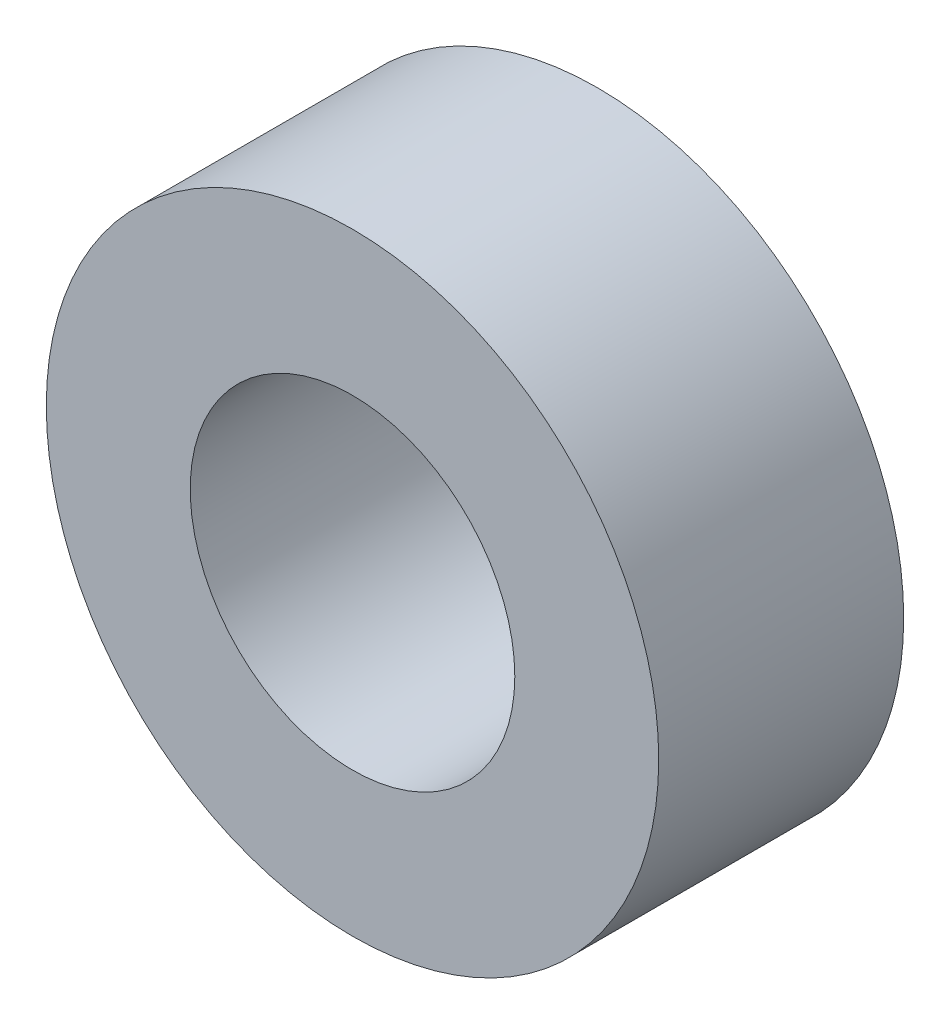
ISO-10303-21;
HEADER;
FILE_DESCRIPTION(('STEP AP214'),'2;1');
FILE_NAME('part.step','',(''),(''),'','','');
FILE_SCHEMA(('AUTOMOTIVE_DESIGN { 1 0 10303 214 1 1 1 1 }'));
ENDSEC;
DATA;
#1=APPLICATION_CONTEXT('core data for automotive mechanical design processes');
#2=APPLICATION_PROTOCOL_DEFINITION('international standard','automotive_design',2000,#1);
#3=PRODUCT_CONTEXT('',#1,'mechanical');
#4=PRODUCT('Part','Part','',(#3));
#5=PRODUCT_RELATED_PRODUCT_CATEGORY('part','',(#4));
#6=PRODUCT_DEFINITION_FORMATION('','',#4);
#7=PRODUCT_DEFINITION_CONTEXT('part definition',#1,'design');
#8=PRODUCT_DEFINITION('design','',#6,#7);
#9=PRODUCT_DEFINITION_SHAPE('','',#8);
#10=(LENGTH_UNIT() NAMED_UNIT(*) SI_UNIT(.MILLI.,.METRE.));
#11=(NAMED_UNIT(*) PLANE_ANGLE_UNIT() SI_UNIT($,.RADIAN.));
#12=(NAMED_UNIT(*) SI_UNIT($,.STERADIAN.) SOLID_ANGLE_UNIT());
#13=UNCERTAINTY_MEASURE_WITH_UNIT(LENGTH_MEASURE(1.E-05),#10,'distance_accuracy_value','');
#14=(GEOMETRIC_REPRESENTATION_CONTEXT(3) GLOBAL_UNCERTAINTY_ASSIGNED_CONTEXT((#13)) GLOBAL_UNIT_ASSIGNED_CONTEXT((#10,
#11,#12)) REPRESENTATION_CONTEXT('',''));
#15=CARTESIAN_POINT('',(0.,0.,0.));
#16=DIRECTION('',(0.,0.,1.));
#17=DIRECTION('',(1.,0.,0.));
#18=AXIS2_PLACEMENT_3D('',#15,#16,#17);
#19=CARTESIAN_POINT('',(0.,0.,2.));
#20=DIRECTION('',(0.,0.,1.));
#21=DIRECTION('',(1.,0.,0.));
#22=AXIS2_PLACEMENT_3D('',#19,#20,#21);
#23=PLANE('',#22);
#24=CARTESIAN_POINT('',(0.,0.,2.));
#25=DIRECTION('',(0.,0.,1.));
#26=DIRECTION('',(1.,0.,0.));
#27=AXIS2_PLACEMENT_3D('',#24,#25,#26);
#28=CIRCLE('',#27,5.);
#29=CARTESIAN_POINT('',(5.,0.,2.));
#30=VERTEX_POINT('',#29);
#31=EDGE_CURVE('E10',#30,#30,#28,.T.);
#32=ORIENTED_EDGE('',*,*,#31,.T.);
#33=EDGE_LOOP('',(#32));
#34=FACE_BOUND('',#33,.T.);
#35=CARTESIAN_POINT('',(0.,0.,2.));
#36=DIRECTION('',(0.,0.,1.));
#37=DIRECTION('',(1.,0.,0.));
#38=AXIS2_PLACEMENT_3D('',#35,#36,#37);
#39=CIRCLE('',#38,2.65);
#40=CARTESIAN_POINT('',(2.65,0.,2.));
#41=VERTEX_POINT('',#40);
#42=EDGE_CURVE('E41',#41,#41,#39,.T.);
#43=ORIENTED_EDGE('',*,*,#42,.F.);
#44=EDGE_LOOP('',(#43));
#45=FACE_BOUND('',#44,.T.);
#46=ADVANCED_FACE('F30',(#34,#45),#23,.T.);
#47=CARTESIAN_POINT('',(0.,0.,-2.));
#48=DIRECTION('',(0.,0.,1.));
#49=DIRECTION('',(1.,0.,0.));
#50=AXIS2_PLACEMENT_3D('',#47,#48,#49);
#51=PLANE('',#50);
#52=CARTESIAN_POINT('',(0.,0.,-2.));
#53=DIRECTION('',(0.,0.,1.));
#54=DIRECTION('',(1.,0.,0.));
#55=AXIS2_PLACEMENT_3D('',#52,#53,#54);
#56=CIRCLE('',#55,5.);
#57=CARTESIAN_POINT('',(5.,0.,-2.));
#58=VERTEX_POINT('',#57);
#59=EDGE_CURVE('E34',#58,#58,#56,.T.);
#60=ORIENTED_EDGE('',*,*,#59,.F.);
#61=EDGE_LOOP('',(#60));
#62=FACE_BOUND('',#61,.T.);
#63=CARTESIAN_POINT('',(0.,0.,-2.));
#64=DIRECTION('',(0.,0.,1.));
#65=DIRECTION('',(1.,0.,0.));
#66=AXIS2_PLACEMENT_3D('',#63,#64,#65);
#67=CIRCLE('',#66,2.65);
#68=CARTESIAN_POINT('',(2.65,0.,-2.));
#69=VERTEX_POINT('',#68);
#70=EDGE_CURVE('E43',#69,#69,#67,.T.);
#71=ORIENTED_EDGE('',*,*,#70,.T.);
#72=EDGE_LOOP('',(#71));
#73=FACE_BOUND('',#72,.T.);
#74=ADVANCED_FACE('F53',(#62,#73),#51,.F.);
#75=CARTESIAN_POINT('',(0.,0.,2.));
#76=DIRECTION('',(0.,0.,-1.));
#77=DIRECTION('',(-1.,0.,0.));
#78=AXIS2_PLACEMENT_3D('',#75,#76,#77);
#79=CYLINDRICAL_SURFACE('',#78,5.);
#80=ORIENTED_EDGE('',*,*,#31,.F.);
#81=EDGE_LOOP('',(#80));
#82=FACE_BOUND('',#81,.T.);
#83=ORIENTED_EDGE('',*,*,#59,.T.);
#84=EDGE_LOOP('',(#83));
#85=FACE_BOUND('',#84,.T.);
#86=ADVANCED_FACE('F32',(#82,#85),#79,.T.);
#87=CARTESIAN_POINT('',(0.,0.,2.));
#88=DIRECTION('',(0.,0.,-1.));
#89=DIRECTION('',(-1.,0.,0.));
#90=AXIS2_PLACEMENT_3D('',#87,#88,#89);
#91=CYLINDRICAL_SURFACE('',#90,2.65);
#92=ORIENTED_EDGE('',*,*,#42,.T.);
#93=EDGE_LOOP('',(#92));
#94=FACE_BOUND('',#93,.T.);
#95=ORIENTED_EDGE('',*,*,#70,.F.);
#96=EDGE_LOOP('',(#95));
#97=FACE_BOUND('',#96,.T.);
#98=ADVANCED_FACE('F49',(#94,#97),#91,.F.);
#99=CLOSED_SHELL('',(#46,#74,#86,#98));
#100=MANIFOLD_SOLID_BREP('B2',#99);
#101=ADVANCED_BREP_SHAPE_REPRESENTATION('',(#18,#100),#14);
#102=SHAPE_DEFINITION_REPRESENTATION(#9,#101);
ENDSEC;
END-ISO-10303-21;
